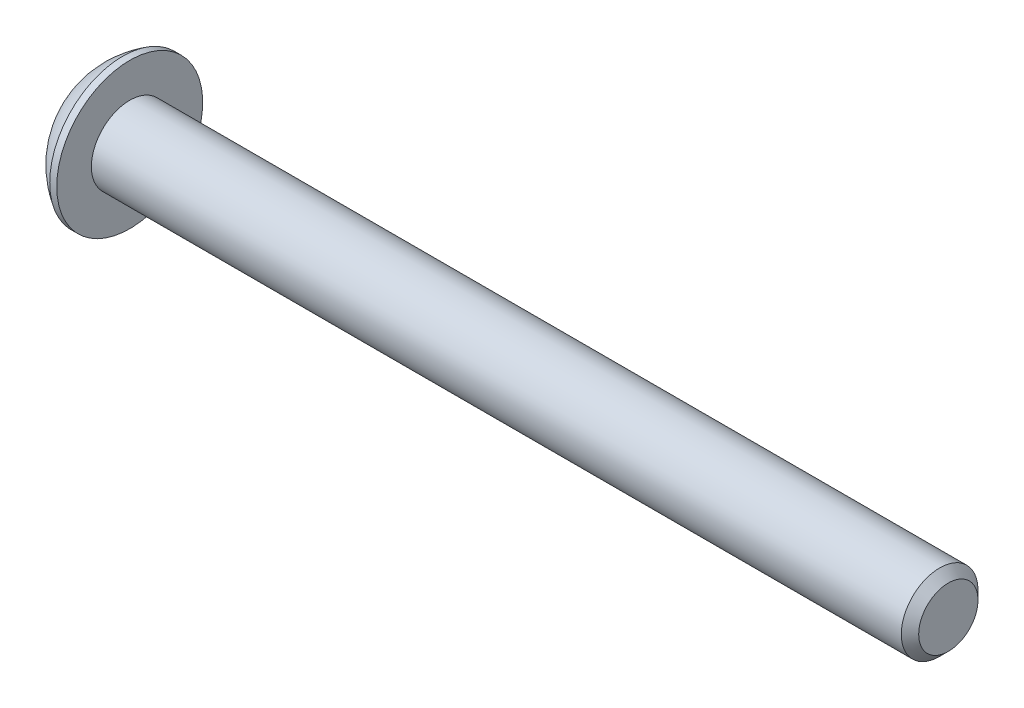
ISO-10303-21;
HEADER;
FILE_DESCRIPTION(('STEP AP214'),'2;1');
FILE_NAME('part.step','',(''),(''),'','','');
FILE_SCHEMA(('AUTOMOTIVE_DESIGN { 1 0 10303 214 1 1 1 1 }'));
ENDSEC;
DATA;
#1=APPLICATION_CONTEXT('core data for automotive mechanical design processes');
#2=APPLICATION_PROTOCOL_DEFINITION('international standard','automotive_design',2000,#1);
#3=PRODUCT_CONTEXT('',#1,'mechanical');
#4=PRODUCT('Part','Part','',(#3));
#5=PRODUCT_RELATED_PRODUCT_CATEGORY('part','',(#4));
#6=PRODUCT_DEFINITION_FORMATION('','',#4);
#7=PRODUCT_DEFINITION_CONTEXT('part definition',#1,'design');
#8=PRODUCT_DEFINITION('design','',#6,#7);
#9=PRODUCT_DEFINITION_SHAPE('','',#8);
#10=(LENGTH_UNIT() NAMED_UNIT(*) SI_UNIT(.MILLI.,.METRE.));
#11=(NAMED_UNIT(*) PLANE_ANGLE_UNIT() SI_UNIT($,.RADIAN.));
#12=(NAMED_UNIT(*) SI_UNIT($,.STERADIAN.) SOLID_ANGLE_UNIT());
#13=UNCERTAINTY_MEASURE_WITH_UNIT(LENGTH_MEASURE(1.E-05),#10,'distance_accuracy_value','');
#14=(GEOMETRIC_REPRESENTATION_CONTEXT(3) GLOBAL_UNCERTAINTY_ASSIGNED_CONTEXT((#13)) GLOBAL_UNIT_ASSIGNED_CONTEXT((#10,
#11,#12)) REPRESENTATION_CONTEXT('',''));
#15=CARTESIAN_POINT('',(0.,0.,0.));
#16=DIRECTION('',(0.,0.,1.));
#17=DIRECTION('',(1.,0.,0.));
#18=AXIS2_PLACEMENT_3D('',#15,#16,#17);
#19=CARTESIAN_POINT('',(1.32080000000034,0.,0.));
#20=DIRECTION('',(-1.,0.,0.));
#21=DIRECTION('',(0.,0.,1.));
#22=AXIS2_PLACEMENT_3D('',#19,#20,#21);
#23=CONICAL_SURFACE('',#22,1.1937999999998,1.04719755119608);
#24=CARTESIAN_POINT('',(2.01004075135902,0.,4.44089209850063E-13));
#25=VERTEX_POINT('',#24);
#26=VERTEX_LOOP('',#25);
#27=FACE_BOUND('',#26,.T.);
#28=CARTESIAN_POINT('',(1.32080000000009,0.,0.));
#29=DIRECTION('',(-1.,0.,0.));
#30=DIRECTION('',(0.,0.,1.));
#31=AXIS2_PLACEMENT_3D('',#28,#29,#30);
#32=CIRCLE('',#31,1.19380000000024);
#33=CARTESIAN_POINT('',(1.32080000000004,-1.03386112703797,0.59690000000006));
#34=VERTEX_POINT('',#33);
#35=CARTESIAN_POINT('',(1.32080000000004,0.,1.19380000000012));
#36=VERTEX_POINT('',#35);
#37=EDGE_CURVE('E19',#34,#36,#32,.T.);
#38=ORIENTED_EDGE('',*,*,#37,.T.);
#39=CARTESIAN_POINT('',(1.32080000000009,0.,0.));
#40=DIRECTION('',(-1.,0.,0.));
#41=DIRECTION('',(0.,0.,1.));
#42=AXIS2_PLACEMENT_3D('',#39,#40,#41);
#43=CIRCLE('',#42,1.19380000000024);
#44=CARTESIAN_POINT('',(1.32080000000004,1.03386112703797,0.596900000000061));
#45=VERTEX_POINT('',#44);
#46=EDGE_CURVE('E148',#36,#45,#43,.T.);
#47=ORIENTED_EDGE('',*,*,#46,.T.);
#48=CARTESIAN_POINT('',(1.32080000000009,0.,0.));
#49=DIRECTION('',(-1.,0.,0.));
#50=DIRECTION('',(0.,0.,1.));
#51=AXIS2_PLACEMENT_3D('',#48,#49,#50);
#52=CIRCLE('',#51,1.19380000000024);
#53=CARTESIAN_POINT('',(1.32080000000004,1.03386112703797,-0.596900000000061));
#54=VERTEX_POINT('',#53);
#55=EDGE_CURVE('E476',#45,#54,#52,.T.);
#56=ORIENTED_EDGE('',*,*,#55,.T.);
#57=CARTESIAN_POINT('',(1.32080000000009,0.,0.));
#58=DIRECTION('',(-1.,0.,0.));
#59=DIRECTION('',(0.,0.,1.));
#60=AXIS2_PLACEMENT_3D('',#57,#58,#59);
#61=CIRCLE('',#60,1.19380000000024);
#62=CARTESIAN_POINT('',(1.32080000000004,1.49457637585666E-12,-1.19380000000012));
#63=VERTEX_POINT('',#62);
#64=EDGE_CURVE('E477',#54,#63,#61,.T.);
#65=ORIENTED_EDGE('',*,*,#64,.T.);
#66=CARTESIAN_POINT('',(1.32080000000009,0.,0.));
#67=DIRECTION('',(-1.,0.,0.));
#68=DIRECTION('',(0.,0.,1.));
#69=AXIS2_PLACEMENT_3D('',#66,#67,#68);
#70=CIRCLE('',#69,1.19380000000024);
#71=CARTESIAN_POINT('',(1.32080000000004,-1.03386112703797,-0.59690000000006));
#72=VERTEX_POINT('',#71);
#73=EDGE_CURVE('E92',#63,#72,#70,.T.);
#74=ORIENTED_EDGE('',*,*,#73,.T.);
#75=CARTESIAN_POINT('',(1.32080000000009,0.,0.));
#76=DIRECTION('',(-1.,0.,0.));
#77=DIRECTION('',(0.,0.,1.));
#78=AXIS2_PLACEMENT_3D('',#75,#76,#77);
#79=CIRCLE('',#78,1.19380000000024);
#80=EDGE_CURVE('E88',#72,#34,#79,.T.);
#81=ORIENTED_EDGE('',*,*,#80,.T.);
#82=EDGE_LOOP('',(#38,#47,#56,#65,#74,#81));
#83=FACE_BOUND('',#82,.T.);
#84=ADVANCED_FACE('F16',(#27,#83),#23,.F.);
#85=CARTESIAN_POINT('',(1.3208,-2.06772225407572,-1.1938));
#86=DIRECTION('',(1.,0.,0.));
#87=DIRECTION('',(0.,0.,-1.));
#88=AXIS2_PLACEMENT_3D('',#85,#86,#87);
#89=PLANE('',#88);
#90=DIRECTION('',(0.,0.5,0.866025403784439));
#91=VECTOR('',#90,1.);
#92=CARTESIAN_POINT('',(1.3208,-1.37848150271715,0.));
#93=LINE('',#92,#91);
#94=CARTESIAN_POINT('',(1.3208,-0.689240751358574,1.1938));
#95=VERTEX_POINT('',#94);
#96=EDGE_CURVE('E100',#95,#34,#93,.F.);
#97=ORIENTED_EDGE('',*,*,#96,.F.);
#98=DIRECTION('',(0.,1.,0.));
#99=VECTOR('',#98,1.);
#100=CARTESIAN_POINT('',(1.3208,-0.689240751358574,1.1938));
#101=LINE('',#100,#99);
#102=EDGE_CURVE('E102',#36,#95,#101,.F.);
#103=ORIENTED_EDGE('',*,*,#102,.F.);
#104=ORIENTED_EDGE('',*,*,#37,.F.);
#105=EDGE_LOOP('',(#97,#103,#104));
#106=FACE_BOUND('',#105,.T.);
#107=ADVANCED_FACE('F98',(#106),#89,.F.);
#108=CARTESIAN_POINT('',(1.3208,-2.06772225407572,-1.1938));
#109=DIRECTION('',(1.,0.,0.));
#110=DIRECTION('',(0.,0.,-1.));
#111=AXIS2_PLACEMENT_3D('',#108,#109,#110);
#112=PLANE('',#111);
#113=DIRECTION('',(0.,-0.5,0.866025403784439));
#114=VECTOR('',#113,1.);
#115=CARTESIAN_POINT('',(1.3208,-0.689240751358574,-1.1938));
#116=LINE('',#115,#114);
#117=CARTESIAN_POINT('',(1.3208,-1.37848150271715,0.));
#118=VERTEX_POINT('',#117);
#119=EDGE_CURVE('E108',#118,#72,#116,.F.);
#120=ORIENTED_EDGE('',*,*,#119,.F.);
#121=DIRECTION('',(0.,0.5,0.866025403784439));
#122=VECTOR('',#121,1.);
#123=CARTESIAN_POINT('',(1.3208,-1.37848150271715,0.));
#124=LINE('',#123,#122);
#125=EDGE_CURVE('E105',#34,#118,#124,.F.);
#126=ORIENTED_EDGE('',*,*,#125,.F.);
#127=ORIENTED_EDGE('',*,*,#80,.F.);
#128=EDGE_LOOP('',(#120,#126,#127));
#129=FACE_BOUND('',#128,.T.);
#130=ADVANCED_FACE('F106',(#129),#112,.F.);
#131=CARTESIAN_POINT('',(1.3208,-2.06772225407572,-1.1938));
#132=DIRECTION('',(1.,0.,0.));
#133=DIRECTION('',(0.,0.,-1.));
#134=AXIS2_PLACEMENT_3D('',#131,#132,#133);
#135=PLANE('',#134);
#136=DIRECTION('',(0.,1.,0.));
#137=VECTOR('',#136,1.);
#138=CARTESIAN_POINT('',(1.3208,0.689240751358577,-1.1938));
#139=LINE('',#138,#137);
#140=CARTESIAN_POINT('',(1.3208,-0.689240751358574,-1.1938));
#141=VERTEX_POINT('',#140);
#142=EDGE_CURVE('E447',#141,#63,#139,.T.);
#143=ORIENTED_EDGE('',*,*,#142,.F.);
#144=DIRECTION('',(0.,-0.5,0.866025403784439));
#145=VECTOR('',#144,1.);
#146=CARTESIAN_POINT('',(1.3208,-0.689240751358574,-1.1938));
#147=LINE('',#146,#145);
#148=EDGE_CURVE('E459',#72,#141,#147,.F.);
#149=ORIENTED_EDGE('',*,*,#148,.F.);
#150=ORIENTED_EDGE('',*,*,#73,.F.);
#151=EDGE_LOOP('',(#143,#149,#150));
#152=FACE_BOUND('',#151,.T.);
#153=ADVANCED_FACE('F191',(#152),#135,.F.);
#154=CARTESIAN_POINT('',(1.3208,-2.06772225407572,-1.1938));
#155=DIRECTION('',(1.,0.,0.));
#156=DIRECTION('',(0.,0.,-1.));
#157=AXIS2_PLACEMENT_3D('',#154,#155,#156);
#158=PLANE('',#157);
#159=DIRECTION('',(0.,-0.5,-0.866025403784439));
#160=VECTOR('',#159,1.);
#161=CARTESIAN_POINT('',(1.3208,1.37848150271715,0.));
#162=LINE('',#161,#160);
#163=CARTESIAN_POINT('',(1.3208,0.689240751358577,-1.1938));
#164=VERTEX_POINT('',#163);
#165=EDGE_CURVE('E433',#164,#54,#162,.F.);
#166=ORIENTED_EDGE('',*,*,#165,.F.);
#167=DIRECTION('',(0.,1.,0.));
#168=VECTOR('',#167,1.);
#169=CARTESIAN_POINT('',(1.3208,0.689240751358577,-1.1938));
#170=LINE('',#169,#168);
#171=EDGE_CURVE('E444',#63,#164,#170,.T.);
#172=ORIENTED_EDGE('',*,*,#171,.F.);
#173=ORIENTED_EDGE('',*,*,#64,.F.);
#174=EDGE_LOOP('',(#166,#172,#173));
#175=FACE_BOUND('',#174,.T.);
#176=ADVANCED_FACE('F187',(#175),#158,.F.);
#177=CARTESIAN_POINT('',(1.3208,-2.06772225407572,-1.1938));
#178=DIRECTION('',(1.,0.,0.));
#179=DIRECTION('',(0.,0.,-1.));
#180=AXIS2_PLACEMENT_3D('',#177,#178,#179);
#181=PLANE('',#180);
#182=DIRECTION('',(0.,0.5,-0.866025403784439));
#183=VECTOR('',#182,1.);
#184=CARTESIAN_POINT('',(1.3208,0.689240751358576,1.1938));
#185=LINE('',#184,#183);
#186=CARTESIAN_POINT('',(1.3208,1.37848150271715,0.));
#187=VERTEX_POINT('',#186);
#188=EDGE_CURVE('E412',#187,#45,#185,.F.);
#189=ORIENTED_EDGE('',*,*,#188,.F.);
#190=DIRECTION('',(0.,-0.5,-0.866025403784439));
#191=VECTOR('',#190,1.);
#192=CARTESIAN_POINT('',(1.3208,1.37848150271715,0.));
#193=LINE('',#192,#191);
#194=EDGE_CURVE('E431',#54,#187,#193,.F.);
#195=ORIENTED_EDGE('',*,*,#194,.F.);
#196=ORIENTED_EDGE('',*,*,#55,.F.);
#197=EDGE_LOOP('',(#189,#195,#196));
#198=FACE_BOUND('',#197,.T.);
#199=ADVANCED_FACE('F183',(#198),#181,.F.);
#200=CARTESIAN_POINT('',(1.3208,-2.06772225407572,-1.1938));
#201=DIRECTION('',(1.,0.,0.));
#202=DIRECTION('',(0.,0.,-1.));
#203=AXIS2_PLACEMENT_3D('',#200,#201,#202);
#204=PLANE('',#203);
#205=DIRECTION('',(0.,1.,0.));
#206=VECTOR('',#205,1.);
#207=CARTESIAN_POINT('',(1.3208,-0.689240751358574,1.1938));
#208=LINE('',#207,#206);
#209=CARTESIAN_POINT('',(1.3208,0.689240751358576,1.1938));
#210=VERTEX_POINT('',#209);
#211=EDGE_CURVE('E117',#210,#36,#208,.F.);
#212=ORIENTED_EDGE('',*,*,#211,.F.);
#213=DIRECTION('',(0.,0.5,-0.866025403784439));
#214=VECTOR('',#213,1.);
#215=CARTESIAN_POINT('',(1.3208,0.689240751358576,1.1938));
#216=LINE('',#215,#214);
#217=EDGE_CURVE('E415',#45,#210,#216,.F.);
#218=ORIENTED_EDGE('',*,*,#217,.F.);
#219=ORIENTED_EDGE('',*,*,#46,.F.);
#220=EDGE_LOOP('',(#212,#218,#219));
#221=FACE_BOUND('',#220,.T.);
#222=ADVANCED_FACE('F179',(#221),#204,.F.);
#223=CARTESIAN_POINT('',(1.3208,-0.689240751358574,1.1938));
#224=DIRECTION('',(0.,0.,-1.));
#225=DIRECTION('',(0.,1.,0.));
#226=AXIS2_PLACEMENT_3D('',#223,#224,#225);
#227=PLANE('',#226);
#228=DIRECTION('',(0.,1.,0.));
#229=VECTOR('',#228,1.);
#230=CARTESIAN_POINT('',(0.,0.,1.1938));
#231=LINE('',#230,#229);
#232=CARTESIAN_POINT('',(0.,0.689240751358577,1.1938));
#233=VERTEX_POINT('',#232);
#234=CARTESIAN_POINT('',(0.,-0.689240751358574,1.1938));
#235=VERTEX_POINT('',#234);
#236=EDGE_CURVE('E409',#233,#235,#231,.F.);
#237=ORIENTED_EDGE('',*,*,#236,.F.);
#238=DIRECTION('',(1.,0.,0.));
#239=VECTOR('',#238,1.);
#240=CARTESIAN_POINT('',(1.3208,0.689240751358576,1.1938));
#241=LINE('',#240,#239);
#242=EDGE_CURVE('E421',#210,#233,#241,.F.);
#243=ORIENTED_EDGE('',*,*,#242,.F.);
#244=ORIENTED_EDGE('',*,*,#211,.T.);
#245=ORIENTED_EDGE('',*,*,#102,.T.);
#246=DIRECTION('',(1.,0.,0.));
#247=VECTOR('',#246,1.);
#248=CARTESIAN_POINT('',(1.3208,-0.689240751358574,1.1938));
#249=LINE('',#248,#247);
#250=EDGE_CURVE('E111',#235,#95,#249,.T.);
#251=ORIENTED_EDGE('',*,*,#250,.F.);
#252=EDGE_LOOP('',(#237,#243,#244,#245,#251));
#253=FACE_BOUND('',#252,.T.);
#254=ADVANCED_FACE('F176',(#253),#227,.T.);
#255=CARTESIAN_POINT('',(1.3208,-1.37848150271715,0.));
#256=DIRECTION('',(0.,0.866025403784439,-0.5));
#257=DIRECTION('',(0.,0.5,0.866025403784439));
#258=AXIS2_PLACEMENT_3D('',#255,#256,#257);
#259=PLANE('',#258);
#260=DIRECTION('',(0.,-0.5,-0.866025403784439));
#261=VECTOR('',#260,1.);
#262=CARTESIAN_POINT('',(0.,-0.689240751358574,1.1938));
#263=LINE('',#262,#261);
#264=CARTESIAN_POINT('',(0.,-1.37848150271715,0.));
#265=VERTEX_POINT('',#264);
#266=EDGE_CURVE('E406',#235,#265,#263,.T.);
#267=ORIENTED_EDGE('',*,*,#266,.F.);
#268=ORIENTED_EDGE('',*,*,#250,.T.);
#269=ORIENTED_EDGE('',*,*,#96,.T.);
#270=ORIENTED_EDGE('',*,*,#125,.T.);
#271=DIRECTION('',(1.,0.,0.));
#272=VECTOR('',#271,1.);
#273=CARTESIAN_POINT('',(1.3208,-1.37848150271715,0.));
#274=LINE('',#273,#272);
#275=EDGE_CURVE('E456',#265,#118,#274,.T.);
#276=ORIENTED_EDGE('',*,*,#275,.F.);
#277=EDGE_LOOP('',(#267,#268,#269,#270,#276));
#278=FACE_BOUND('',#277,.T.);
#279=ADVANCED_FACE('F115',(#278),#259,.T.);
#280=CARTESIAN_POINT('',(1.3208,-0.689240751358574,-1.1938));
#281=DIRECTION('',(0.,0.866025403784439,0.5));
#282=DIRECTION('',(0.,-0.5,0.866025403784439));
#283=AXIS2_PLACEMENT_3D('',#280,#281,#282);
#284=PLANE('',#283);
#285=DIRECTION('',(0.,0.5,-0.866025403784439));
#286=VECTOR('',#285,1.);
#287=CARTESIAN_POINT('',(0.,-1.37848150271715,0.));
#288=LINE('',#287,#286);
#289=CARTESIAN_POINT('',(0.,-0.689240751358574,-1.1938));
#290=VERTEX_POINT('',#289);
#291=EDGE_CURVE('E403',#265,#290,#288,.T.);
#292=ORIENTED_EDGE('',*,*,#291,.F.);
#293=ORIENTED_EDGE('',*,*,#275,.T.);
#294=ORIENTED_EDGE('',*,*,#119,.T.);
#295=ORIENTED_EDGE('',*,*,#148,.T.);
#296=DIRECTION('',(1.,0.,0.));
#297=VECTOR('',#296,1.);
#298=CARTESIAN_POINT('',(1.3208,-0.689240751358574,-1.1938));
#299=LINE('',#298,#297);
#300=EDGE_CURVE('E441',#290,#141,#299,.T.);
#301=ORIENTED_EDGE('',*,*,#300,.F.);
#302=EDGE_LOOP('',(#292,#293,#294,#295,#301));
#303=FACE_BOUND('',#302,.T.);
#304=ADVANCED_FACE('F169',(#303),#284,.T.);
#305=CARTESIAN_POINT('',(1.3208,0.689240751358577,-1.1938));
#306=DIRECTION('',(0.,0.,1.));
#307=DIRECTION('',(1.,0.,0.));
#308=AXIS2_PLACEMENT_3D('',#305,#306,#307);
#309=PLANE('',#308);
#310=DIRECTION('',(0.,1.,0.));
#311=VECTOR('',#310,1.);
#312=CARTESIAN_POINT('',(0.,0.,-1.1938));
#313=LINE('',#312,#311);
#314=CARTESIAN_POINT('',(0.,0.689240751358577,-1.1938));
#315=VERTEX_POINT('',#314);
#316=EDGE_CURVE('E400',#290,#315,#313,.T.);
#317=ORIENTED_EDGE('',*,*,#316,.F.);
#318=ORIENTED_EDGE('',*,*,#300,.T.);
#319=ORIENTED_EDGE('',*,*,#142,.T.);
#320=ORIENTED_EDGE('',*,*,#171,.T.);
#321=DIRECTION('',(1.,0.,0.));
#322=VECTOR('',#321,1.);
#323=CARTESIAN_POINT('',(1.3208,0.689240751358577,-1.1938));
#324=LINE('',#323,#322);
#325=EDGE_CURVE('E416',#315,#164,#324,.T.);
#326=ORIENTED_EDGE('',*,*,#325,.F.);
#327=EDGE_LOOP('',(#317,#318,#319,#320,#326));
#328=FACE_BOUND('',#327,.T.);
#329=ADVANCED_FACE('F166',(#328),#309,.T.);
#330=CARTESIAN_POINT('',(1.3208,1.37848150271715,0.));
#331=DIRECTION('',(0.,-0.866025403784439,0.5));
#332=DIRECTION('',(0.,-0.5,-0.866025403784439));
#333=AXIS2_PLACEMENT_3D('',#330,#331,#332);
#334=PLANE('',#333);
#335=DIRECTION('',(0.,0.5,0.866025403784439));
#336=VECTOR('',#335,1.);
#337=CARTESIAN_POINT('',(0.,0.689240751358577,-1.1938));
#338=LINE('',#337,#336);
#339=CARTESIAN_POINT('',(0.,1.37848150271715,0.));
#340=VERTEX_POINT('',#339);
#341=EDGE_CURVE('E397',#315,#340,#338,.T.);
#342=ORIENTED_EDGE('',*,*,#341,.F.);
#343=ORIENTED_EDGE('',*,*,#325,.T.);
#344=ORIENTED_EDGE('',*,*,#165,.T.);
#345=ORIENTED_EDGE('',*,*,#194,.T.);
#346=DIRECTION('',(1.,0.,0.));
#347=VECTOR('',#346,1.);
#348=CARTESIAN_POINT('',(1.3208,1.37848150271715,0.));
#349=LINE('',#348,#347);
#350=EDGE_CURVE('E34',#340,#187,#349,.T.);
#351=ORIENTED_EDGE('',*,*,#350,.F.);
#352=EDGE_LOOP('',(#342,#343,#344,#345,#351));
#353=FACE_BOUND('',#352,.T.);
#354=ADVANCED_FACE('F162',(#353),#334,.T.);
#355=CARTESIAN_POINT('',(1.3208,0.689240751358576,1.1938));
#356=DIRECTION('',(0.,-0.866025403784439,-0.5));
#357=DIRECTION('',(0.,0.5,-0.866025403784439));
#358=AXIS2_PLACEMENT_3D('',#355,#356,#357);
#359=PLANE('',#358);
#360=DIRECTION('',(0.,-0.5,0.866025403784439));
#361=VECTOR('',#360,1.);
#362=CARTESIAN_POINT('',(0.,1.37848150271715,0.));
#363=LINE('',#362,#361);
#364=EDGE_CURVE('E147',#340,#233,#363,.T.);
#365=ORIENTED_EDGE('',*,*,#364,.F.);
#366=ORIENTED_EDGE('',*,*,#350,.T.);
#367=ORIENTED_EDGE('',*,*,#188,.T.);
#368=ORIENTED_EDGE('',*,*,#217,.T.);
#369=ORIENTED_EDGE('',*,*,#242,.T.);
#370=EDGE_LOOP('',(#365,#366,#367,#368,#369));
#371=FACE_BOUND('',#370,.T.);
#372=ADVANCED_FACE('F158',(#371),#359,.T.);
#373=CARTESIAN_POINT('',(0.,0.,0.));
#374=DIRECTION('',(-1.,0.,0.));
#375=DIRECTION('',(0.,0.,1.));
#376=AXIS2_PLACEMENT_3D('',#373,#374,#375);
#377=PLANE('',#376);
#378=ORIENTED_EDGE('',*,*,#341,.T.);
#379=ORIENTED_EDGE('',*,*,#364,.T.);
#380=ORIENTED_EDGE('',*,*,#236,.T.);
#381=ORIENTED_EDGE('',*,*,#266,.T.);
#382=ORIENTED_EDGE('',*,*,#291,.T.);
#383=ORIENTED_EDGE('',*,*,#316,.T.);
#384=EDGE_LOOP('',(#378,#379,#380,#381,#382,#383));
#385=FACE_BOUND('',#384,.T.);
#386=CARTESIAN_POINT('',(0.,1.9812,0.));
#387=CARTESIAN_POINT('',(0.,1.9811996664299,0.0556258831179428));
#388=CARTESIAN_POINT('',(0.,1.97885520380442,0.111261989398606));
#389=CARTESIAN_POINT('',(0.,1.96949260169541,0.222149719830458));
#390=CARTESIAN_POINT('',(0.,1.96247308239605,0.277401225602895));
#391=CARTESIAN_POINT('',(0.,1.94379192841038,0.387209508139747));
#392=CARTESIAN_POINT('',(-1.85325793235264E-13,1.93212292489526,0.441765039546365));
#393=CARTESIAN_POINT('',(1.86344214223505E-13,1.90422331175315,0.549729449347493));
#394=CARTESIAN_POINT('',(6.94543371897454E-13,1.88798900035338,0.603137359208869));
#395=CARTESIAN_POINT('',(1.15501975216981E-12,1.83266214476501,0.760839131321828));
#396=CARTESIAN_POINT('',(0.,1.78690023648845,0.862876433575429));
#397=CARTESIAN_POINT('',(0.,1.67887358150667,1.05780719540872));
#398=CARTESIAN_POINT('',(9.54193214892627E-13,1.6166082074585,1.15070030720801));
#399=CARTESIAN_POINT('',(5.94805591894675E-13,1.51224157140982,1.28116890915697));
#400=CARTESIAN_POINT('',(1.63221293851378E-13,1.4755970394354,1.32320451127026));
#401=CARTESIAN_POINT('',(-1.62196980336157E-13,1.39893832619713,1.40400288695709));
#402=CARTESIAN_POINT('',(0.,1.35892742784698,1.44276877695455));
#403=CARTESIAN_POINT('',(1.14362537325405E-13,1.23416504602197,1.55382272417904));
#404=CARTESIAN_POINT('',(0.,1.14466125559859,1.62089527952111));
#405=CARTESIAN_POINT('',(0.,0.955712144178167,1.7390221808118));
#406=CARTESIAN_POINT('',(0.,0.856267198233564,1.79007713076007));
#407=CARTESIAN_POINT('',(0.,0.650206345910843,1.87477637530954));
#408=CARTESIAN_POINT('',(0.,0.543590516134855,1.90842085586267));
#409=CARTESIAN_POINT('',(0.,0.326226155292018,1.95733039300656));
#410=CARTESIAN_POINT('',(0.,0.21547760215793,1.97259535144288));
#411=CARTESIAN_POINT('',(0.,-0.00701040587544639,1.98431697865418));
#412=CARTESIAN_POINT('',(0.,-0.118749860774734,1.98077364742917));
#413=CARTESIAN_POINT('',(0.,-0.340050178355485,1.95497485623825));
#414=CARTESIAN_POINT('',(0.,-0.449611052668255,1.93271949620218));
#415=CARTESIAN_POINT('',(0.,-0.663431110729174,1.87014138774523));
#416=CARTESIAN_POINT('',(0.,-0.76769023783852,1.82981844635272));
#417=CARTESIAN_POINT('',(0.,-0.968005760719347,1.73219968377096));
#418=CARTESIAN_POINT('',(0.,-1.0640618469811,1.6749032225164));
#419=CARTESIAN_POINT('',(0.,-1.19980276751283,1.57757371205873));
#420=CARTESIAN_POINT('',(0.,-1.24366557129213,1.54322665019466));
#421=CARTESIAN_POINT('',(0.,-1.32838995706696,1.47093063174264));
#422=CARTESIAN_POINT('',(0.,-1.36924860178706,1.43297823102439));
#423=CARTESIAN_POINT('',(0.,-1.48674671849223,1.31419842051173));
#424=CARTESIAN_POINT('',(0.,-1.55842832343237,1.22836221289311));
#425=CARTESIAN_POINT('',(0.,-1.6863396856475,1.04586168272493));
#426=CARTESIAN_POINT('',(0.,-1.7425700302488,0.949197771949774));
#427=CARTESIAN_POINT('',(0.,-1.8141614250401,0.798182600298684));
#428=CARTESIAN_POINT('',(0.,-1.83591780585875,0.746776203847791));
#429=CARTESIAN_POINT('',(0.,-1.87500754181092,0.642341081688636));
#430=CARTESIAN_POINT('',(0.,-1.89234447645404,0.589313708122847));
#431=CARTESIAN_POINT('',(0.,-1.92246053433554,0.482076273028395));
#432=CARTESIAN_POINT('',(0.,-1.93524685475118,0.42786822425751));
#433=CARTESIAN_POINT('',(0.,-1.95620937250494,0.318578151844611));
#434=CARTESIAN_POINT('',(0.,-1.96438692958147,0.263496390912872));
#435=CARTESIAN_POINT('',(0.,-1.97388528284653,0.173607715038558));
#436=CARTESIAN_POINT('',(0.,-1.97662743364426,0.138944718024998));
#437=CARTESIAN_POINT('',(0.,-1.98028489645283,0.0695224782567002));
#438=CARTESIAN_POINT('',(0.,-1.98120020846367,0.0347632355019631));
#439=CARTESIAN_POINT('',(0.,-1.9811996664299,-0.0556258831179437));
#440=CARTESIAN_POINT('',(0.,-1.97885520380442,-0.111261989398607));
#441=CARTESIAN_POINT('',(0.,-1.96949260169541,-0.222149719830459));
#442=CARTESIAN_POINT('',(0.,-1.96247308239605,-0.277401225602897));
#443=CARTESIAN_POINT('',(0.,-1.94379192841039,-0.387209508139749));
#444=CARTESIAN_POINT('',(-1.85269749640691E-13,-1.93212292489526,-0.441765039546367));
#445=CARTESIAN_POINT('',(1.86288125054388E-13,-1.90422331175315,-0.549729449347495));
#446=CARTESIAN_POINT('',(6.94525090263764E-13,-1.88798900035338,-0.603137359208872));
#447=CARTESIAN_POINT('',(1.15505622829081E-12,-1.83266214476501,-0.760839131321831));
#448=CARTESIAN_POINT('',(0.,-1.78690023648845,-0.862876433575431));
#449=CARTESIAN_POINT('',(0.,-1.67887358150667,-1.05780719540872));
#450=CARTESIAN_POINT('',(9.54248812869379E-13,-1.6166082074585,-1.15070030720801));
#451=CARTESIAN_POINT('',(5.94777756479239E-13,-1.51224157140982,-1.28116890915698));
#452=CARTESIAN_POINT('',(1.63138949183833E-13,-1.47559703943539,-1.32320451127027));
#453=CARTESIAN_POINT('',(-1.62114715061273E-13,-1.39893832619713,-1.40400288695709));
#454=CARTESIAN_POINT('',(0.,-1.35892742784699,-1.44276877695455));
#455=CARTESIAN_POINT('',(1.13760489124207E-13,-1.23416504602197,-1.55382272417904));
#456=CARTESIAN_POINT('',(0.,-1.14466125559859,-1.62089527952111));
#457=CARTESIAN_POINT('',(0.,-0.95571214417816,-1.73902218081179));
#458=CARTESIAN_POINT('',(0.,-0.856267198233559,-1.79007713076007));
#459=CARTESIAN_POINT('',(0.,-0.650206345910841,-1.87477637530954));
#460=CARTESIAN_POINT('',(0.,-0.543590516134854,-1.90842085586267));
#461=CARTESIAN_POINT('',(0.,-0.326226155292018,-1.95733039300657));
#462=CARTESIAN_POINT('',(0.,-0.215477602157929,-1.97259535144288));
#463=CARTESIAN_POINT('',(0.,0.0070104058754487,-1.98431697865418));
#464=CARTESIAN_POINT('',(0.,0.118749860774737,-1.98077364742916));
#465=CARTESIAN_POINT('',(0.,0.340050178355489,-1.95497485623824));
#466=CARTESIAN_POINT('',(0.,0.44961105266826,-1.93271949620218));
#467=CARTESIAN_POINT('',(0.,0.663431110729178,-1.87014138774524));
#468=CARTESIAN_POINT('',(0.,0.767690237838524,-1.82981844635272));
#469=CARTESIAN_POINT('',(0.,0.968005760719348,-1.73219968377096));
#470=CARTESIAN_POINT('',(0.,1.0640618469811,-1.67490322251639));
#471=CARTESIAN_POINT('',(0.,1.19980276751283,-1.57757371205873));
#472=CARTESIAN_POINT('',(0.,1.24366557129214,-1.54322665019465));
#473=CARTESIAN_POINT('',(0.,1.32838995706696,-1.47093063174263));
#474=CARTESIAN_POINT('',(0.,1.36924860178706,-1.43297823102439));
#475=CARTESIAN_POINT('',(0.,1.48674671849223,-1.31419842051172));
#476=CARTESIAN_POINT('',(0.,1.55842832343237,-1.22836221289311));
#477=CARTESIAN_POINT('',(0.,1.6863396856475,-1.04586168272492));
#478=CARTESIAN_POINT('',(0.,1.7425700302488,-0.949197771949768));
#479=CARTESIAN_POINT('',(0.,1.8141614250401,-0.798182600298677));
#480=CARTESIAN_POINT('',(0.,1.83591780585875,-0.746776203847785));
#481=CARTESIAN_POINT('',(0.,1.87500754181092,-0.64234108168863));
#482=CARTESIAN_POINT('',(0.,1.89234447645404,-0.589313708122841));
#483=CARTESIAN_POINT('',(0.,1.92246053433555,-0.482076273028389));
#484=CARTESIAN_POINT('',(0.,1.93524685475118,-0.427868224257505));
#485=CARTESIAN_POINT('',(0.,1.95620937250494,-0.318578151844605));
#486=CARTESIAN_POINT('',(0.,1.96438692958147,-0.263496390912866));
#487=CARTESIAN_POINT('',(0.,1.97388528284653,-0.173607715038553));
#488=CARTESIAN_POINT('',(0.,1.97662743364426,-0.138944718024994));
#489=CARTESIAN_POINT('',(0.,1.98028489645283,-0.0695224782566989));
#490=CARTESIAN_POINT('',(0.,1.98120020846367,-0.034763235501963));
#491=CARTESIAN_POINT('',(0.,1.9812,0.));
#492=B_SPLINE_CURVE_WITH_KNOTS('',3,(#386,#387,#388,#389,#390,#391,#392,#393,#394,#395,#396,
#397,#398,#399,#400,#401,#402,#403,#404,#405,#406,#407,#408,#409,#410,#411,#412,#413,#414,#415,
#416,#417,#418,#419,#420,#421,#422,#423,#424,#425,#426,#427,#428,#429,#430,#431,#432,#433,#434,
#435,#436,#437,#438,#439,#440,#441,#442,#443,#444,#445,#446,#447,#448,#449,#450,#451,#452,#453,
#454,#455,#456,#457,#458,#459,#460,#461,#462,#463,#464,#465,#466,#467,#468,#469,#470,#471,#472,
#473,#474,#475,#476,#477,#478,#479,#480,#481,#482,#483,#484,#485,#486,#487,#488,#489,#490,#491),
.UNSPECIFIED.,.T.,.F.,(4,2,2,2,2,2,2,2,2,2,2,2,2,2,2,2,2,2,2,2,2,2,2,2,2,2,2,2,2,2,2,2,2,2,2,2,
2,2,2,2,2,2,2,2,2,2,2,2,2,2,2,2,4),(0.,0.166845646007828,0.333740557374255,0.500901034367693,
0.668197445942386,1.00199278686282,1.33580081809885,1.50292354032982,1.6698851310853,
2.00370118900129,2.33750465770544,2.67130456115909,3.005106247238,3.33890793331696,
3.67270783677065,4.00651130547476,4.34032736339026,4.50728895414554,4.67441167637632,
5.00821970761259,5.34201504853332,5.50931146010827,5.67647193710191,5.84336684846844,
6.0102124944764,6.11448220058334,6.21875190669029,6.38559755269812,6.55249246406454,
6.71965294105798,6.88694935263268,7.22074469355311,7.55455272478915,7.72167544702011,
7.88863703777559,8.22245309569158,8.55625656439573,8.89005646784938,9.2238581539283,
9.55765984000725,9.89145974346094,10.2252632121651,10.5590792700806,10.7260408608358,
10.8931635830666,11.2269716143029,11.5607669552236,11.7280633667986,11.8952238437922,
12.0621187551587,12.2289644011667,12.3332341072736,12.4375038133806),.UNSPECIFIED.);
#493=CARTESIAN_POINT('',(0.,1.9812,0.));
#494=VERTEX_POINT('',#493);
#495=EDGE_CURVE('E139',#494,#494,#492,.T.);
#496=ORIENTED_EDGE('',*,*,#495,.F.);
#497=EDGE_LOOP('',(#496));
#498=FACE_BOUND('',#497,.T.);
#499=ADVANCED_FACE('F154',(#385,#498),#377,.T.);
#500=CARTESIAN_POINT('',(4.13385,0.,0.));
#501=DIRECTION('',(0.,1.,0.));
#502=DIRECTION('',(1.,0.,0.));
#503=AXIS2_PLACEMENT_3D('',#500,#501,#502);
#504=SPHERICAL_SURFACE('',#503,4.58408870578439);
#505=CARTESIAN_POINT('',(1.8288,0.,0.));
#506=DIRECTION('',(-1.,0.,0.));
#507=DIRECTION('',(0.,0.,1.));
#508=AXIS2_PLACEMENT_3D('',#505,#506,#507);
#509=CIRCLE('',#508,3.9624);
#510=CARTESIAN_POINT('',(1.8288,0.,3.9624));
#511=VERTEX_POINT('',#510);
#512=EDGE_CURVE('E136',#511,#511,#509,.F.);
#513=ORIENTED_EDGE('',*,*,#512,.F.);
#514=EDGE_LOOP('',(#513));
#515=FACE_BOUND('',#514,.T.);
#516=ORIENTED_EDGE('',*,*,#495,.T.);
#517=EDGE_LOOP('',(#516));
#518=FACE_BOUND('',#517,.T.);
#519=ADVANCED_FACE('F150',(#515,#518),#504,.T.);
#520=CARTESIAN_POINT('',(46.6598,0.,0.));
#521=DIRECTION('',(-1.,0.,0.));
#522=DIRECTION('',(0.,0.,1.));
#523=AXIS2_PLACEMENT_3D('',#520,#521,#522);
#524=PLANE('',#523);
#525=CARTESIAN_POINT('',(46.6597999999863,0.,0.));
#526=DIRECTION('',(-1.,0.,0.));
#527=DIRECTION('',(0.,0.,1.));
#528=AXIS2_PLACEMENT_3D('',#525,#526,#527);
#529=CIRCLE('',#528,1.61036000002923);
#530=CARTESIAN_POINT('',(46.6597999999863,0.,1.61036000002923));
#531=VERTEX_POINT('',#530);
#532=EDGE_CURVE('E133',#531,#531,#529,.T.);
#533=ORIENTED_EDGE('',*,*,#532,.F.);
#534=EDGE_LOOP('',(#533));
#535=FACE_BOUND('',#534,.T.);
#536=ADVANCED_FACE('F221',(#535),#524,.F.);
#537=CARTESIAN_POINT('',(0.,0.,0.));
#538=DIRECTION('',(-1.,0.,0.));
#539=DIRECTION('',(0.,0.,1.));
#540=AXIS2_PLACEMENT_3D('',#537,#538,#539);
#541=CYLINDRICAL_SURFACE('',#540,3.9624);
#542=ORIENTED_EDGE('',*,*,#512,.T.);
#543=EDGE_LOOP('',(#542));
#544=FACE_BOUND('',#543,.T.);
#545=CARTESIAN_POINT('',(2.2098,0.,0.));
#546=DIRECTION('',(-1.,0.,0.));
#547=DIRECTION('',(0.,0.,1.));
#548=AXIS2_PLACEMENT_3D('',#545,#546,#547);
#549=CIRCLE('',#548,3.9624);
#550=CARTESIAN_POINT('',(2.2098,0.,3.9624));
#551=VERTEX_POINT('',#550);
#552=EDGE_CURVE('E130',#551,#551,#549,.T.);
#553=ORIENTED_EDGE('',*,*,#552,.T.);
#554=EDGE_LOOP('',(#553));
#555=FACE_BOUND('',#554,.T.);
#556=ADVANCED_FACE('F218',(#544,#555),#541,.T.);
#557=CARTESIAN_POINT('',(46.1873600000899,0.,0.));
#558=DIRECTION('',(-1.,0.,0.));
#559=DIRECTION('',(0.,0.,1.));
#560=AXIS2_PLACEMENT_3D('',#557,#558,#559);
#561=CONICAL_SURFACE('',#560,2.08279999992556,0.785398163397448);
#562=CARTESIAN_POINT('',(46.18736,0.,0.));
#563=DIRECTION('',(-1.,0.,0.));
#564=DIRECTION('',(0.,0.,1.));
#565=AXIS2_PLACEMENT_3D('',#562,#563,#564);
#566=CIRCLE('',#565,2.0828);
#567=CARTESIAN_POINT('',(46.18736,0.,2.0828));
#568=VERTEX_POINT('',#567);
#569=EDGE_CURVE('E25',#568,#568,#566,.T.);
#570=ORIENTED_EDGE('',*,*,#569,.F.);
#571=EDGE_LOOP('',(#570));
#572=FACE_BOUND('',#571,.T.);
#573=ORIENTED_EDGE('',*,*,#532,.T.);
#574=EDGE_LOOP('',(#573));
#575=FACE_BOUND('',#574,.T.);
#576=ADVANCED_FACE('F211',(#572,#575),#561,.T.);
#577=CARTESIAN_POINT('',(2.2098,2.0828,0.));
#578=DIRECTION('',(-1.,0.,0.));
#579=DIRECTION('',(0.,0.,1.));
#580=AXIS2_PLACEMENT_3D('',#577,#578,#579);
#581=PLANE('',#580);
#582=CARTESIAN_POINT('',(2.2098,0.,0.));
#583=DIRECTION('',(-1.,0.,0.));
#584=DIRECTION('',(0.,0.,1.));
#585=AXIS2_PLACEMENT_3D('',#582,#583,#584);
#586=CIRCLE('',#585,2.0828);
#587=CARTESIAN_POINT('',(2.2098,0.,2.0828));
#588=VERTEX_POINT('',#587);
#589=EDGE_CURVE('E11',#588,#588,#586,.F.);
#590=ORIENTED_EDGE('',*,*,#589,.F.);
#591=EDGE_LOOP('',(#590));
#592=FACE_BOUND('',#591,.T.);
#593=ORIENTED_EDGE('',*,*,#552,.F.);
#594=EDGE_LOOP('',(#593));
#595=FACE_BOUND('',#594,.T.);
#596=ADVANCED_FACE('F205',(#592,#595),#581,.F.);
#597=CARTESIAN_POINT('',(0.,0.,0.));
#598=DIRECTION('',(-1.,0.,0.));
#599=DIRECTION('',(0.,0.,1.));
#600=AXIS2_PLACEMENT_3D('',#597,#598,#599);
#601=CYLINDRICAL_SURFACE('',#600,2.0828);
#602=ORIENTED_EDGE('',*,*,#589,.T.);
#603=EDGE_LOOP('',(#602));
#604=FACE_BOUND('',#603,.T.);
#605=ORIENTED_EDGE('',*,*,#569,.T.);
#606=EDGE_LOOP('',(#605));
#607=FACE_BOUND('',#606,.T.);
#608=ADVANCED_FACE('F203',(#604,#607),#601,.T.);
#609=CLOSED_SHELL('',(#84,#107,#130,#153,#176,#199,#222,#254,#279,#304,#329,#354,#372,#499,#519,
#536,#556,#576,#596,#608));
#610=MANIFOLD_SOLID_BREP('B1',#609);
#611=ADVANCED_BREP_SHAPE_REPRESENTATION('',(#18,#610),#14);
#612=SHAPE_DEFINITION_REPRESENTATION(#9,#611);
ENDSEC;
END-ISO-10303-21;
